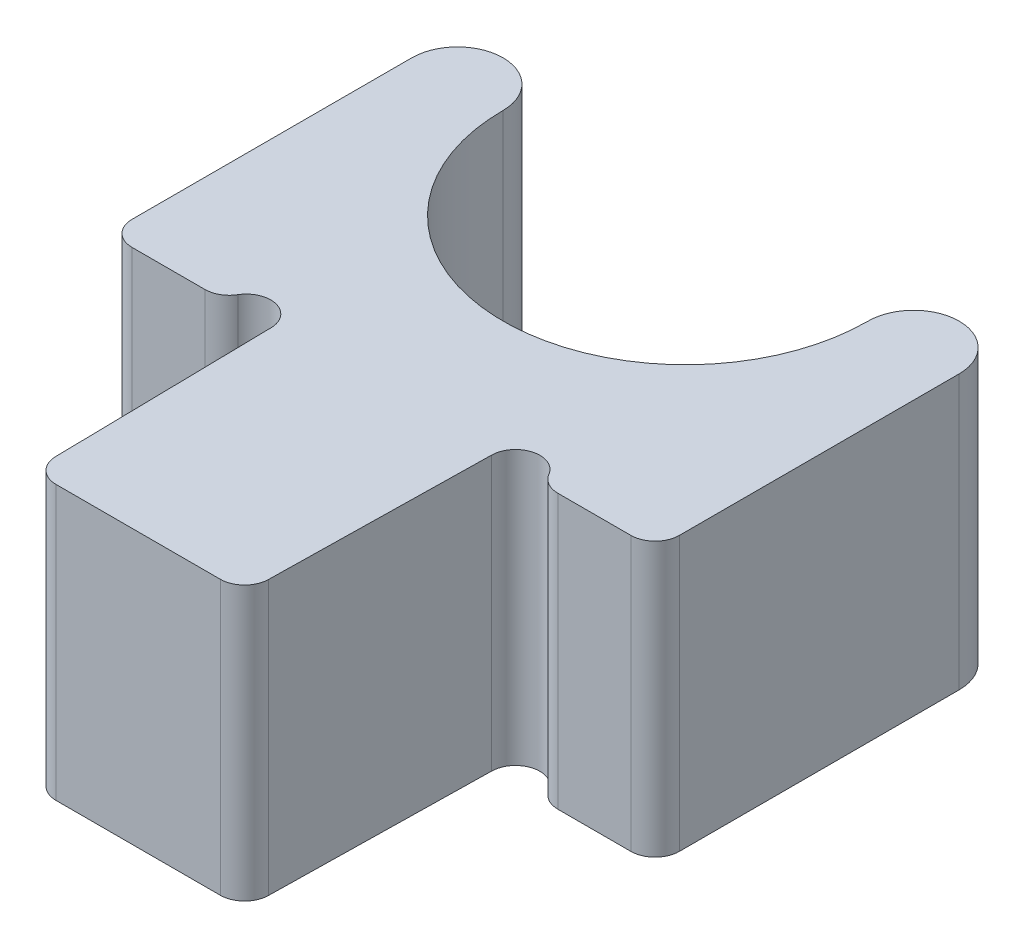
ISO-10303-21;
HEADER;
FILE_DESCRIPTION(('STEP AP214'),'2;1');
FILE_NAME('part.step','',(''),(''),'','','');
FILE_SCHEMA(('AUTOMOTIVE_DESIGN { 1 0 10303 214 1 1 1 1 }'));
ENDSEC;
DATA;
#1=APPLICATION_CONTEXT('core data for automotive mechanical design processes');
#2=APPLICATION_PROTOCOL_DEFINITION('international standard','automotive_design',2000,#1);
#3=PRODUCT_CONTEXT('',#1,'mechanical');
#4=PRODUCT('Part','Part','',(#3));
#5=PRODUCT_RELATED_PRODUCT_CATEGORY('part','',(#4));
#6=PRODUCT_DEFINITION_FORMATION('','',#4);
#7=PRODUCT_DEFINITION_CONTEXT('part definition',#1,'design');
#8=PRODUCT_DEFINITION('design','',#6,#7);
#9=PRODUCT_DEFINITION_SHAPE('','',#8);
#10=(LENGTH_UNIT() NAMED_UNIT(*) SI_UNIT(.MILLI.,.METRE.));
#11=(NAMED_UNIT(*) PLANE_ANGLE_UNIT() SI_UNIT($,.RADIAN.));
#12=(NAMED_UNIT(*) SI_UNIT($,.STERADIAN.) SOLID_ANGLE_UNIT());
#13=UNCERTAINTY_MEASURE_WITH_UNIT(LENGTH_MEASURE(1.E-05),#10,'distance_accuracy_value','');
#14=(GEOMETRIC_REPRESENTATION_CONTEXT(3) GLOBAL_UNCERTAINTY_ASSIGNED_CONTEXT((#13)) GLOBAL_UNIT_ASSIGNED_CONTEXT((#10,
#11,#12)) REPRESENTATION_CONTEXT('',''));
#15=CARTESIAN_POINT('',(0.,0.,0.));
#16=DIRECTION('',(0.,0.,1.));
#17=DIRECTION('',(1.,0.,0.));
#18=AXIS2_PLACEMENT_3D('',#15,#16,#17);
#19=CARTESIAN_POINT('',(-3.75,4.5,0.));
#20=DIRECTION('',(0.,-1.,0.));
#21=DIRECTION('',(0.,0.,-1.));
#22=AXIS2_PLACEMENT_3D('',#19,#20,#21);
#23=CYLINDRICAL_SURFACE('',#22,0.750000000000001);
#24=CARTESIAN_POINT('',(-3.75,0.,0.));
#25=DIRECTION('',(0.,1.,0.));
#26=DIRECTION('',(0.,0.,1.));
#27=AXIS2_PLACEMENT_3D('',#24,#25,#26);
#28=CIRCLE('',#27,0.750000000000001);
#29=CARTESIAN_POINT('',(-3.,0.,0.));
#30=VERTEX_POINT('',#29);
#31=CARTESIAN_POINT('',(-4.5,0.,0.));
#32=VERTEX_POINT('',#31);
#33=EDGE_CURVE('E189',#30,#32,#28,.T.);
#34=ORIENTED_EDGE('',*,*,#33,.T.);
#35=DIRECTION('',(0.,-1.,0.));
#36=VECTOR('',#35,1.);
#37=CARTESIAN_POINT('',(-4.5,4.5,0.));
#38=LINE('',#37,#36);
#39=CARTESIAN_POINT('',(-4.5,4.5,0.));
#40=VERTEX_POINT('',#39);
#41=EDGE_CURVE('E11',#40,#32,#38,.T.);
#42=ORIENTED_EDGE('',*,*,#41,.F.);
#43=CARTESIAN_POINT('',(-3.75,4.5,0.));
#44=DIRECTION('',(0.,1.,0.));
#45=DIRECTION('',(0.,0.,1.));
#46=AXIS2_PLACEMENT_3D('',#43,#44,#45);
#47=CIRCLE('',#46,0.750000000000001);
#48=CARTESIAN_POINT('',(-3.,4.5,0.));
#49=VERTEX_POINT('',#48);
#50=EDGE_CURVE('E223',#49,#40,#47,.T.);
#51=ORIENTED_EDGE('',*,*,#50,.F.);
#52=DIRECTION('',(0.,-1.,0.));
#53=VECTOR('',#52,1.);
#54=CARTESIAN_POINT('',(-3.,4.5,0.));
#55=LINE('',#54,#53);
#56=EDGE_CURVE('E185',#49,#30,#55,.T.);
#57=ORIENTED_EDGE('',*,*,#56,.T.);
#58=EDGE_LOOP('',(#34,#42,#51,#57));
#59=FACE_BOUND('',#58,.T.);
#60=ADVANCED_FACE('F33',(#59),#23,.T.);
#61=CARTESIAN_POINT('',(-4.5,4.5,0.));
#62=DIRECTION('',(1.,0.,0.));
#63=DIRECTION('',(0.,0.,-1.));
#64=AXIS2_PLACEMENT_3D('',#61,#62,#63);
#65=PLANE('',#64);
#66=DIRECTION('',(0.,0.,1.));
#67=VECTOR('',#66,1.);
#68=CARTESIAN_POINT('',(-4.5,0.,0.));
#69=LINE('',#68,#67);
#70=CARTESIAN_POINT('',(-4.5,0.,4.6));
#71=VERTEX_POINT('',#70);
#72=EDGE_CURVE('E192',#32,#71,#69,.T.);
#73=ORIENTED_EDGE('',*,*,#72,.T.);
#74=DIRECTION('',(0.,-1.,0.));
#75=VECTOR('',#74,1.);
#76=CARTESIAN_POINT('',(-4.5,4.5,4.6));
#77=LINE('',#76,#75);
#78=CARTESIAN_POINT('',(-4.5,4.5,4.6));
#79=VERTEX_POINT('',#78);
#80=EDGE_CURVE('E41',#79,#71,#77,.T.);
#81=ORIENTED_EDGE('',*,*,#80,.F.);
#82=DIRECTION('',(0.,0.,1.));
#83=VECTOR('',#82,1.);
#84=CARTESIAN_POINT('',(-4.5,4.5,0.));
#85=LINE('',#84,#83);
#86=EDGE_CURVE('E122',#40,#79,#85,.T.);
#87=ORIENTED_EDGE('',*,*,#86,.F.);
#88=ORIENTED_EDGE('',*,*,#41,.T.);
#89=EDGE_LOOP('',(#73,#81,#87,#88));
#90=FACE_BOUND('',#89,.T.);
#91=ADVANCED_FACE('F331',(#90),#65,.F.);
#92=CARTESIAN_POINT('',(-4.1,4.5,4.6));
#93=DIRECTION('',(0.,-1.,0.));
#94=DIRECTION('',(0.,0.,-1.));
#95=AXIS2_PLACEMENT_3D('',#92,#93,#94);
#96=CYLINDRICAL_SURFACE('',#95,0.4);
#97=CARTESIAN_POINT('',(-4.1,0.,4.6));
#98=DIRECTION('',(0.,1.,0.));
#99=DIRECTION('',(0.,0.,1.));
#100=AXIS2_PLACEMENT_3D('',#97,#98,#99);
#101=CIRCLE('',#100,0.4);
#102=CARTESIAN_POINT('',(-4.1,0.,5.));
#103=VERTEX_POINT('',#102);
#104=EDGE_CURVE('E194',#71,#103,#101,.T.);
#105=ORIENTED_EDGE('',*,*,#104,.T.);
#106=DIRECTION('',(0.,-1.,0.));
#107=VECTOR('',#106,1.);
#108=CARTESIAN_POINT('',(-4.1,4.5,5.));
#109=LINE('',#108,#107);
#110=CARTESIAN_POINT('',(-4.1,4.5,5.));
#111=VERTEX_POINT('',#110);
#112=EDGE_CURVE('E260',#111,#103,#109,.T.);
#113=ORIENTED_EDGE('',*,*,#112,.F.);
#114=CARTESIAN_POINT('',(-4.1,4.5,4.6));
#115=DIRECTION('',(0.,1.,0.));
#116=DIRECTION('',(0.,0.,1.));
#117=AXIS2_PLACEMENT_3D('',#114,#115,#116);
#118=CIRCLE('',#117,0.4);
#119=EDGE_CURVE('E268',#79,#111,#118,.T.);
#120=ORIENTED_EDGE('',*,*,#119,.F.);
#121=ORIENTED_EDGE('',*,*,#80,.T.);
#122=EDGE_LOOP('',(#105,#113,#120,#121));
#123=FACE_BOUND('',#122,.T.);
#124=ADVANCED_FACE('F266',(#123),#96,.T.);
#125=CARTESIAN_POINT('',(-2.90164185719014,4.5,5.));
#126=DIRECTION('',(0.,0.,-1.));
#127=DIRECTION('',(-1.,0.,0.));
#128=AXIS2_PLACEMENT_3D('',#125,#126,#127);
#129=PLANE('',#128);
#130=DIRECTION('',(1.,0.,0.));
#131=VECTOR('',#130,1.);
#132=CARTESIAN_POINT('',(-2.90164185719014,0.,5.));
#133=LINE('',#132,#131);
#134=CARTESIAN_POINT('',(-2.90164185719014,0.,5.));
#135=VERTEX_POINT('',#134);
#136=EDGE_CURVE('E196',#103,#135,#133,.T.);
#137=ORIENTED_EDGE('',*,*,#136,.T.);
#138=DIRECTION('',(0.,-1.,0.));
#139=VECTOR('',#138,1.);
#140=CARTESIAN_POINT('',(-2.90164185719014,4.5,5.));
#141=LINE('',#140,#139);
#142=CARTESIAN_POINT('',(-2.90164185719014,4.5,5.));
#143=VERTEX_POINT('',#142);
#144=EDGE_CURVE('E257',#143,#135,#141,.T.);
#145=ORIENTED_EDGE('',*,*,#144,.F.);
#146=DIRECTION('',(1.,0.,0.));
#147=VECTOR('',#146,1.);
#148=CARTESIAN_POINT('',(-2.90164185719014,4.5,5.));
#149=LINE('',#148,#147);
#150=EDGE_CURVE('E286',#111,#143,#149,.T.);
#151=ORIENTED_EDGE('',*,*,#150,.F.);
#152=ORIENTED_EDGE('',*,*,#112,.T.);
#153=EDGE_LOOP('',(#137,#145,#151,#152));
#154=FACE_BOUND('',#153,.T.);
#155=ADVANCED_FACE('F277',(#154),#129,.F.);
#156=CARTESIAN_POINT('',(-2.90164185719014,4.5,4.6));
#157=DIRECTION('',(0.,-1.,0.));
#158=DIRECTION('',(0.,0.,-1.));
#159=AXIS2_PLACEMENT_3D('',#156,#157,#158);
#160=CYLINDRICAL_SURFACE('',#159,0.4);
#161=CARTESIAN_POINT('',(-2.90164185719014,0.,4.6));
#162=DIRECTION('',(0.,1.,0.));
#163=DIRECTION('',(0.,0.,-1.));
#164=AXIS2_PLACEMENT_3D('',#161,#162,#163);
#165=CIRCLE('',#164,0.4);
#166=CARTESIAN_POINT('',(-2.55727051107464,0.,4.80349048128746));
#167=VERTEX_POINT('',#166);
#168=EDGE_CURVE('E198',#135,#167,#165,.T.);
#169=ORIENTED_EDGE('',*,*,#168,.T.);
#170=DIRECTION('',(0.,-1.,0.));
#171=VECTOR('',#170,1.);
#172=CARTESIAN_POINT('',(-2.55727051107464,4.5,4.80349048128746));
#173=LINE('',#172,#171);
#174=CARTESIAN_POINT('',(-2.55727051107464,4.5,4.80349048128746));
#175=VERTEX_POINT('',#174);
#176=EDGE_CURVE('E254',#175,#167,#173,.T.);
#177=ORIENTED_EDGE('',*,*,#176,.F.);
#178=CARTESIAN_POINT('',(-2.90164185719014,4.5,4.6));
#179=DIRECTION('',(0.,1.,0.));
#180=DIRECTION('',(0.,0.,-1.));
#181=AXIS2_PLACEMENT_3D('',#178,#179,#180);
#182=CIRCLE('',#181,0.4);
#183=EDGE_CURVE('E283',#143,#175,#182,.T.);
#184=ORIENTED_EDGE('',*,*,#183,.F.);
#185=ORIENTED_EDGE('',*,*,#144,.T.);
#186=EDGE_LOOP('',(#169,#177,#184,#185));
#187=FACE_BOUND('',#186,.T.);
#188=ADVANCED_FACE('F281',(#187),#160,.T.);
#189=CARTESIAN_POINT('',(-2.21289916495914,4.5,5.00698096257492));
#190=DIRECTION('',(0.,-1.,0.));
#191=DIRECTION('',(0.,0.,-1.));
#192=AXIS2_PLACEMENT_3D('',#189,#190,#191);
#193=CYLINDRICAL_SURFACE('',#192,0.4);
#194=CARTESIAN_POINT('',(-2.21289916495914,0.,5.00698096257492));
#195=DIRECTION('',(0.,-1.,0.));
#196=DIRECTION('',(0.,0.,1.));
#197=AXIS2_PLACEMENT_3D('',#194,#195,#196);
#198=CIRCLE('',#197,0.4);
#199=CARTESIAN_POINT('',(-1.81296008689659,0.,5.));
#200=VERTEX_POINT('',#199);
#201=EDGE_CURVE('E200',#167,#200,#198,.T.);
#202=ORIENTED_EDGE('',*,*,#201,.T.);
#203=DIRECTION('',(0.,-1.,0.));
#204=VECTOR('',#203,1.);
#205=CARTESIAN_POINT('',(-1.81296008689659,4.5,5.));
#206=LINE('',#205,#204);
#207=CARTESIAN_POINT('',(-1.81296008689659,4.5,5.));
#208=VERTEX_POINT('',#207);
#209=EDGE_CURVE('E251',#208,#200,#206,.T.);
#210=ORIENTED_EDGE('',*,*,#209,.F.);
#211=CARTESIAN_POINT('',(-2.21289916495914,4.5,5.00698096257492));
#212=DIRECTION('',(0.,-1.,0.));
#213=DIRECTION('',(0.,0.,1.));
#214=AXIS2_PLACEMENT_3D('',#211,#212,#213);
#215=CIRCLE('',#214,0.4);
#216=EDGE_CURVE('E285',#175,#208,#215,.T.);
#217=ORIENTED_EDGE('',*,*,#216,.F.);
#218=ORIENTED_EDGE('',*,*,#176,.T.);
#219=EDGE_LOOP('',(#202,#210,#217,#218));
#220=FACE_BOUND('',#219,.T.);
#221=ADVANCED_FACE('F344',(#220),#193,.F.);
#222=CARTESIAN_POINT('',(-1.81296008689659,4.5,5.));
#223=DIRECTION('',(0.999847695156391,0.,-0.0174524064372839));
#224=DIRECTION('',(-0.0174524064372839,0.,-0.999847695156391));
#225=AXIS2_PLACEMENT_3D('',#222,#223,#224);
#226=PLANE('',#225);
#227=DIRECTION('',(0.0174524064372839,0.,0.999847695156391));
#228=VECTOR('',#227,1.);
#229=CARTESIAN_POINT('',(-1.81296008689659,0.,5.));
#230=LINE('',#229,#228);
#231=CARTESIAN_POINT('',(-1.75,0.,8.60698096257492));
#232=VERTEX_POINT('',#231);
#233=EDGE_CURVE('E202',#200,#232,#230,.T.);
#234=ORIENTED_EDGE('',*,*,#233,.T.);
#235=DIRECTION('',(0.,-1.,0.));
#236=VECTOR('',#235,1.);
#237=CARTESIAN_POINT('',(-1.75,4.5,8.60698096257492));
#238=LINE('',#237,#236);
#239=CARTESIAN_POINT('',(-1.75,4.5,8.60698096257492));
#240=VERTEX_POINT('',#239);
#241=EDGE_CURVE('E248',#240,#232,#238,.T.);
#242=ORIENTED_EDGE('',*,*,#241,.F.);
#243=DIRECTION('',(0.0174524064372839,0.,0.999847695156391));
#244=VECTOR('',#243,1.);
#245=CARTESIAN_POINT('',(-1.81296008689659,4.5,5.));
#246=LINE('',#245,#244);
#247=EDGE_CURVE('E288',#208,#240,#246,.T.);
#248=ORIENTED_EDGE('',*,*,#247,.F.);
#249=ORIENTED_EDGE('',*,*,#209,.T.);
#250=EDGE_LOOP('',(#234,#242,#248,#249));
#251=FACE_BOUND('',#250,.T.);
#252=ADVANCED_FACE('F347',(#251),#226,.F.);
#253=CARTESIAN_POINT('',(-1.35006092193744,4.5,8.6));
#254=DIRECTION('',(0.,-1.,0.));
#255=DIRECTION('',(0.,0.,-1.));
#256=AXIS2_PLACEMENT_3D('',#253,#254,#255);
#257=CYLINDRICAL_SURFACE('',#256,0.4);
#258=CARTESIAN_POINT('',(-1.35006092193744,0.,8.6));
#259=DIRECTION('',(0.,1.,0.));
#260=DIRECTION('',(0.,0.,1.));
#261=AXIS2_PLACEMENT_3D('',#258,#259,#260);
#262=CIRCLE('',#261,0.4);
#263=CARTESIAN_POINT('',(-1.35006092193744,0.,9.));
#264=VERTEX_POINT('',#263);
#265=EDGE_CURVE('E204',#232,#264,#262,.T.);
#266=ORIENTED_EDGE('',*,*,#265,.T.);
#267=DIRECTION('',(0.,-1.,0.));
#268=VECTOR('',#267,1.);
#269=CARTESIAN_POINT('',(-1.35006092193744,4.5,9.));
#270=LINE('',#269,#268);
#271=CARTESIAN_POINT('',(-1.35006092193744,4.5,9.));
#272=VERTEX_POINT('',#271);
#273=EDGE_CURVE('E245',#272,#264,#270,.T.);
#274=ORIENTED_EDGE('',*,*,#273,.F.);
#275=CARTESIAN_POINT('',(-1.35006092193744,4.5,8.6));
#276=DIRECTION('',(0.,1.,0.));
#277=DIRECTION('',(0.,0.,1.));
#278=AXIS2_PLACEMENT_3D('',#275,#276,#277);
#279=CIRCLE('',#278,0.4);
#280=EDGE_CURVE('E294',#240,#272,#279,.T.);
#281=ORIENTED_EDGE('',*,*,#280,.F.);
#282=ORIENTED_EDGE('',*,*,#241,.T.);
#283=EDGE_LOOP('',(#266,#274,#281,#282));
#284=FACE_BOUND('',#283,.T.);
#285=ADVANCED_FACE('F351',(#284),#257,.T.);
#286=CARTESIAN_POINT('',(1.35006092193744,4.5,9.));
#287=DIRECTION('',(0.,0.,-1.));
#288=DIRECTION('',(-1.,0.,0.));
#289=AXIS2_PLACEMENT_3D('',#286,#287,#288);
#290=PLANE('',#289);
#291=DIRECTION('',(1.,0.,0.));
#292=VECTOR('',#291,1.);
#293=CARTESIAN_POINT('',(1.35006092193744,0.,9.));
#294=LINE('',#293,#292);
#295=CARTESIAN_POINT('',(1.35006092193744,0.,9.));
#296=VERTEX_POINT('',#295);
#297=EDGE_CURVE('E206',#264,#296,#294,.T.);
#298=ORIENTED_EDGE('',*,*,#297,.T.);
#299=DIRECTION('',(0.,-1.,0.));
#300=VECTOR('',#299,1.);
#301=CARTESIAN_POINT('',(1.35006092193744,4.5,9.));
#302=LINE('',#301,#300);
#303=CARTESIAN_POINT('',(1.35006092193744,4.5,9.));
#304=VERTEX_POINT('',#303);
#305=EDGE_CURVE('E242',#304,#296,#302,.T.);
#306=ORIENTED_EDGE('',*,*,#305,.F.);
#307=DIRECTION('',(1.,0.,0.));
#308=VECTOR('',#307,1.);
#309=CARTESIAN_POINT('',(1.35006092193744,4.5,9.));
#310=LINE('',#309,#308);
#311=EDGE_CURVE('E296',#272,#304,#310,.T.);
#312=ORIENTED_EDGE('',*,*,#311,.F.);
#313=ORIENTED_EDGE('',*,*,#273,.T.);
#314=EDGE_LOOP('',(#298,#306,#312,#313));
#315=FACE_BOUND('',#314,.T.);
#316=ADVANCED_FACE('F355',(#315),#290,.F.);
#317=CARTESIAN_POINT('',(1.35006092193744,4.5,8.6));
#318=DIRECTION('',(0.,-1.,0.));
#319=DIRECTION('',(0.,0.,-1.));
#320=AXIS2_PLACEMENT_3D('',#317,#318,#319);
#321=CYLINDRICAL_SURFACE('',#320,0.4);
#322=CARTESIAN_POINT('',(1.35006092193744,0.,8.6));
#323=DIRECTION('',(0.,1.,0.));
#324=DIRECTION('',(0.,0.,-1.));
#325=AXIS2_PLACEMENT_3D('',#322,#323,#324);
#326=CIRCLE('',#325,0.4);
#327=CARTESIAN_POINT('',(1.75,0.,8.60698096257492));
#328=VERTEX_POINT('',#327);
#329=EDGE_CURVE('E208',#296,#328,#326,.T.);
#330=ORIENTED_EDGE('',*,*,#329,.T.);
#331=DIRECTION('',(0.,-1.,0.));
#332=VECTOR('',#331,1.);
#333=CARTESIAN_POINT('',(1.75,4.5,8.60698096257492));
#334=LINE('',#333,#332);
#335=CARTESIAN_POINT('',(1.75,4.5,8.60698096257492));
#336=VERTEX_POINT('',#335);
#337=EDGE_CURVE('E239',#336,#328,#334,.T.);
#338=ORIENTED_EDGE('',*,*,#337,.F.);
#339=CARTESIAN_POINT('',(1.35006092193744,4.5,8.6));
#340=DIRECTION('',(0.,1.,0.));
#341=DIRECTION('',(0.,0.,-1.));
#342=AXIS2_PLACEMENT_3D('',#339,#340,#341);
#343=CIRCLE('',#342,0.4);
#344=EDGE_CURVE('E298',#304,#336,#343,.T.);
#345=ORIENTED_EDGE('',*,*,#344,.F.);
#346=ORIENTED_EDGE('',*,*,#305,.T.);
#347=EDGE_LOOP('',(#330,#338,#345,#346));
#348=FACE_BOUND('',#347,.T.);
#349=ADVANCED_FACE('F359',(#348),#321,.T.);
#350=CARTESIAN_POINT('',(1.81296008689659,4.5,5.));
#351=DIRECTION('',(-0.999847695156391,0.,-0.0174524064372836));
#352=DIRECTION('',(-0.0174524064372836,0.,0.999847695156391));
#353=AXIS2_PLACEMENT_3D('',#350,#351,#352);
#354=PLANE('',#353);
#355=DIRECTION('',(0.0174524064372836,0.,-0.999847695156391));
#356=VECTOR('',#355,1.);
#357=CARTESIAN_POINT('',(1.81296008689659,0.,5.));
#358=LINE('',#357,#356);
#359=CARTESIAN_POINT('',(1.81296008689659,0.,5.));
#360=VERTEX_POINT('',#359);
#361=EDGE_CURVE('E210',#328,#360,#358,.T.);
#362=ORIENTED_EDGE('',*,*,#361,.T.);
#363=DIRECTION('',(0.,-1.,0.));
#364=VECTOR('',#363,1.);
#365=CARTESIAN_POINT('',(1.81296008689659,4.5,5.));
#366=LINE('',#365,#364);
#367=CARTESIAN_POINT('',(1.81296008689659,4.5,5.));
#368=VERTEX_POINT('',#367);
#369=EDGE_CURVE('E236',#368,#360,#366,.T.);
#370=ORIENTED_EDGE('',*,*,#369,.F.);
#371=DIRECTION('',(0.0174524064372836,0.,-0.999847695156391));
#372=VECTOR('',#371,1.);
#373=CARTESIAN_POINT('',(1.81296008689659,4.5,5.));
#374=LINE('',#373,#372);
#375=EDGE_CURVE('E300',#336,#368,#374,.T.);
#376=ORIENTED_EDGE('',*,*,#375,.F.);
#377=ORIENTED_EDGE('',*,*,#337,.T.);
#378=EDGE_LOOP('',(#362,#370,#376,#377));
#379=FACE_BOUND('',#378,.T.);
#380=ADVANCED_FACE('F363',(#379),#354,.F.);
#381=CARTESIAN_POINT('',(2.21289916495915,4.5,5.00698096257491));
#382=DIRECTION('',(0.,-1.,0.));
#383=DIRECTION('',(0.,0.,-1.));
#384=AXIS2_PLACEMENT_3D('',#381,#382,#383);
#385=CYLINDRICAL_SURFACE('',#384,0.4);
#386=CARTESIAN_POINT('',(2.21289916495915,0.,5.00698096257491));
#387=DIRECTION('',(0.,-1.,0.));
#388=DIRECTION('',(0.,0.,-1.));
#389=AXIS2_PLACEMENT_3D('',#386,#387,#388);
#390=CIRCLE('',#389,0.4);
#391=CARTESIAN_POINT('',(2.55727051107464,0.,4.80349048128746));
#392=VERTEX_POINT('',#391);
#393=EDGE_CURVE('E212',#360,#392,#390,.T.);
#394=ORIENTED_EDGE('',*,*,#393,.T.);
#395=DIRECTION('',(0.,-1.,0.));
#396=VECTOR('',#395,1.);
#397=CARTESIAN_POINT('',(2.55727051107464,4.5,4.80349048128746));
#398=LINE('',#397,#396);
#399=CARTESIAN_POINT('',(2.55727051107464,4.5,4.80349048128746));
#400=VERTEX_POINT('',#399);
#401=EDGE_CURVE('E233',#400,#392,#398,.T.);
#402=ORIENTED_EDGE('',*,*,#401,.F.);
#403=CARTESIAN_POINT('',(2.21289916495915,4.5,5.00698096257491));
#404=DIRECTION('',(0.,-1.,0.));
#405=DIRECTION('',(0.,0.,-1.));
#406=AXIS2_PLACEMENT_3D('',#403,#404,#405);
#407=CIRCLE('',#406,0.4);
#408=EDGE_CURVE('E302',#368,#400,#407,.T.);
#409=ORIENTED_EDGE('',*,*,#408,.F.);
#410=ORIENTED_EDGE('',*,*,#369,.T.);
#411=EDGE_LOOP('',(#394,#402,#409,#410));
#412=FACE_BOUND('',#411,.T.);
#413=ADVANCED_FACE('F367',(#412),#385,.F.);
#414=CARTESIAN_POINT('',(2.90164185719014,4.5,4.6));
#415=DIRECTION('',(0.,-1.,0.));
#416=DIRECTION('',(0.,0.,-1.));
#417=AXIS2_PLACEMENT_3D('',#414,#415,#416);
#418=CYLINDRICAL_SURFACE('',#417,0.4);
#419=CARTESIAN_POINT('',(2.90164185719014,0.,4.6));
#420=DIRECTION('',(0.,1.,0.));
#421=DIRECTION('',(0.,0.,1.));
#422=AXIS2_PLACEMENT_3D('',#419,#420,#421);
#423=CIRCLE('',#422,0.4);
#424=CARTESIAN_POINT('',(2.90164185719014,0.,5.));
#425=VERTEX_POINT('',#424);
#426=EDGE_CURVE('E214',#392,#425,#423,.T.);
#427=ORIENTED_EDGE('',*,*,#426,.T.);
#428=DIRECTION('',(0.,-1.,0.));
#429=VECTOR('',#428,1.);
#430=CARTESIAN_POINT('',(2.90164185719014,4.5,5.));
#431=LINE('',#430,#429);
#432=CARTESIAN_POINT('',(2.90164185719014,4.5,5.));
#433=VERTEX_POINT('',#432);
#434=EDGE_CURVE('E230',#433,#425,#431,.T.);
#435=ORIENTED_EDGE('',*,*,#434,.F.);
#436=CARTESIAN_POINT('',(2.90164185719014,4.5,4.6));
#437=DIRECTION('',(0.,1.,0.));
#438=DIRECTION('',(0.,0.,1.));
#439=AXIS2_PLACEMENT_3D('',#436,#437,#438);
#440=CIRCLE('',#439,0.4);
#441=EDGE_CURVE('E304',#400,#433,#440,.T.);
#442=ORIENTED_EDGE('',*,*,#441,.F.);
#443=ORIENTED_EDGE('',*,*,#401,.T.);
#444=EDGE_LOOP('',(#427,#435,#442,#443));
#445=FACE_BOUND('',#444,.T.);
#446=ADVANCED_FACE('F371',(#445),#418,.T.);
#447=CARTESIAN_POINT('',(2.90164185719014,4.5,5.));
#448=DIRECTION('',(0.,0.,-1.));
#449=DIRECTION('',(-1.,0.,0.));
#450=AXIS2_PLACEMENT_3D('',#447,#448,#449);
#451=PLANE('',#450);
#452=DIRECTION('',(1.,0.,0.));
#453=VECTOR('',#452,1.);
#454=CARTESIAN_POINT('',(2.90164185719014,0.,5.));
#455=LINE('',#454,#453);
#456=CARTESIAN_POINT('',(4.1,0.,5.));
#457=VERTEX_POINT('',#456);
#458=EDGE_CURVE('E216',#425,#457,#455,.T.);
#459=ORIENTED_EDGE('',*,*,#458,.T.);
#460=DIRECTION('',(0.,-1.,0.));
#461=VECTOR('',#460,1.);
#462=CARTESIAN_POINT('',(4.1,4.5,5.));
#463=LINE('',#462,#461);
#464=CARTESIAN_POINT('',(4.1,4.5,5.));
#465=VERTEX_POINT('',#464);
#466=EDGE_CURVE('E227',#465,#457,#463,.T.);
#467=ORIENTED_EDGE('',*,*,#466,.F.);
#468=DIRECTION('',(1.,0.,0.));
#469=VECTOR('',#468,1.);
#470=CARTESIAN_POINT('',(2.90164185719014,4.5,5.));
#471=LINE('',#470,#469);
#472=EDGE_CURVE('E306',#433,#465,#471,.T.);
#473=ORIENTED_EDGE('',*,*,#472,.F.);
#474=ORIENTED_EDGE('',*,*,#434,.T.);
#475=EDGE_LOOP('',(#459,#467,#473,#474));
#476=FACE_BOUND('',#475,.T.);
#477=ADVANCED_FACE('F312',(#476),#451,.F.);
#478=CARTESIAN_POINT('',(4.1,4.5,4.6));
#479=DIRECTION('',(0.,-1.,0.));
#480=DIRECTION('',(0.,0.,-1.));
#481=AXIS2_PLACEMENT_3D('',#478,#479,#480);
#482=CYLINDRICAL_SURFACE('',#481,0.4);
#483=CARTESIAN_POINT('',(4.1,0.,4.6));
#484=DIRECTION('',(0.,1.,0.));
#485=DIRECTION('',(0.,0.,-1.));
#486=AXIS2_PLACEMENT_3D('',#483,#484,#485);
#487=CIRCLE('',#486,0.4);
#488=CARTESIAN_POINT('',(4.5,0.,4.6));
#489=VERTEX_POINT('',#488);
#490=EDGE_CURVE('E218',#457,#489,#487,.T.);
#491=ORIENTED_EDGE('',*,*,#490,.T.);
#492=DIRECTION('',(0.,-1.,0.));
#493=VECTOR('',#492,1.);
#494=CARTESIAN_POINT('',(4.5,4.5,4.6));
#495=LINE('',#494,#493);
#496=CARTESIAN_POINT('',(4.5,4.5,4.6));
#497=VERTEX_POINT('',#496);
#498=EDGE_CURVE('E180',#497,#489,#495,.T.);
#499=ORIENTED_EDGE('',*,*,#498,.F.);
#500=CARTESIAN_POINT('',(4.1,4.5,4.6));
#501=DIRECTION('',(0.,1.,0.));
#502=DIRECTION('',(0.,0.,-1.));
#503=AXIS2_PLACEMENT_3D('',#500,#501,#502);
#504=CIRCLE('',#503,0.4);
#505=EDGE_CURVE('E171',#465,#497,#504,.T.);
#506=ORIENTED_EDGE('',*,*,#505,.F.);
#507=ORIENTED_EDGE('',*,*,#466,.T.);
#508=EDGE_LOOP('',(#491,#499,#506,#507));
#509=FACE_BOUND('',#508,.T.);
#510=ADVANCED_FACE('F316',(#509),#482,.T.);
#511=CARTESIAN_POINT('',(4.5,4.5,0.));
#512=DIRECTION('',(-1.,0.,0.));
#513=DIRECTION('',(0.,0.,1.));
#514=AXIS2_PLACEMENT_3D('',#511,#512,#513);
#515=PLANE('',#514);
#516=DIRECTION('',(0.,0.,-1.));
#517=VECTOR('',#516,1.);
#518=CARTESIAN_POINT('',(4.5,0.,0.));
#519=LINE('',#518,#517);
#520=CARTESIAN_POINT('',(4.5,0.,0.));
#521=VERTEX_POINT('',#520);
#522=EDGE_CURVE('E179',#489,#521,#519,.T.);
#523=ORIENTED_EDGE('',*,*,#522,.T.);
#524=DIRECTION('',(0.,-1.,0.));
#525=VECTOR('',#524,1.);
#526=CARTESIAN_POINT('',(4.5,4.5,0.));
#527=LINE('',#526,#525);
#528=CARTESIAN_POINT('',(4.5,4.5,0.));
#529=VERTEX_POINT('',#528);
#530=EDGE_CURVE('E176',#529,#521,#527,.T.);
#531=ORIENTED_EDGE('',*,*,#530,.F.);
#532=DIRECTION('',(0.,0.,-1.));
#533=VECTOR('',#532,1.);
#534=CARTESIAN_POINT('',(4.5,4.5,0.));
#535=LINE('',#534,#533);
#536=EDGE_CURVE('E165',#497,#529,#535,.T.);
#537=ORIENTED_EDGE('',*,*,#536,.F.);
#538=ORIENTED_EDGE('',*,*,#498,.T.);
#539=EDGE_LOOP('',(#523,#531,#537,#538));
#540=FACE_BOUND('',#539,.T.);
#541=ADVANCED_FACE('F177',(#540),#515,.F.);
#542=CARTESIAN_POINT('',(3.75,4.5,0.));
#543=DIRECTION('',(0.,-1.,0.));
#544=DIRECTION('',(0.,0.,-1.));
#545=AXIS2_PLACEMENT_3D('',#542,#543,#544);
#546=CYLINDRICAL_SURFACE('',#545,0.750000000000001);
#547=CARTESIAN_POINT('',(3.75,0.,0.));
#548=DIRECTION('',(0.,1.,0.));
#549=DIRECTION('',(0.,0.,-1.));
#550=AXIS2_PLACEMENT_3D('',#547,#548,#549);
#551=CIRCLE('',#550,0.750000000000001);
#552=CARTESIAN_POINT('',(3.,0.,0.));
#553=VERTEX_POINT('',#552);
#554=EDGE_CURVE('E108',#521,#553,#551,.T.);
#555=ORIENTED_EDGE('',*,*,#554,.T.);
#556=DIRECTION('',(0.,-1.,0.));
#557=VECTOR('',#556,1.);
#558=CARTESIAN_POINT('',(3.,4.5,0.));
#559=LINE('',#558,#557);
#560=CARTESIAN_POINT('',(3.,4.5,0.));
#561=VERTEX_POINT('',#560);
#562=EDGE_CURVE('E181',#561,#553,#559,.T.);
#563=ORIENTED_EDGE('',*,*,#562,.F.);
#564=CARTESIAN_POINT('',(3.75,4.5,0.));
#565=DIRECTION('',(0.,1.,0.));
#566=DIRECTION('',(0.,0.,-1.));
#567=AXIS2_PLACEMENT_3D('',#564,#565,#566);
#568=CIRCLE('',#567,0.750000000000001);
#569=EDGE_CURVE('E169',#529,#561,#568,.T.);
#570=ORIENTED_EDGE('',*,*,#569,.F.);
#571=ORIENTED_EDGE('',*,*,#530,.T.);
#572=EDGE_LOOP('',(#555,#563,#570,#571));
#573=FACE_BOUND('',#572,.T.);
#574=ADVANCED_FACE('F183',(#573),#546,.T.);
#575=CARTESIAN_POINT('',(0.,4.5,0.));
#576=DIRECTION('',(0.,-1.,0.));
#577=DIRECTION('',(0.,0.,-1.));
#578=AXIS2_PLACEMENT_3D('',#575,#576,#577);
#579=CYLINDRICAL_SURFACE('',#578,3.);
#580=CARTESIAN_POINT('',(0.,0.,0.));
#581=DIRECTION('',(0.,-1.,0.));
#582=DIRECTION('',(0.,0.,1.));
#583=AXIS2_PLACEMENT_3D('',#580,#581,#582);
#584=CIRCLE('',#583,3.);
#585=EDGE_CURVE('E114',#553,#30,#584,.T.);
#586=ORIENTED_EDGE('',*,*,#585,.T.);
#587=ORIENTED_EDGE('',*,*,#56,.F.);
#588=CARTESIAN_POINT('',(0.,4.5,0.));
#589=DIRECTION('',(0.,-1.,0.));
#590=DIRECTION('',(0.,0.,1.));
#591=AXIS2_PLACEMENT_3D('',#588,#589,#590);
#592=CIRCLE('',#591,3.);
#593=EDGE_CURVE('E49',#561,#49,#592,.T.);
#594=ORIENTED_EDGE('',*,*,#593,.F.);
#595=ORIENTED_EDGE('',*,*,#562,.T.);
#596=EDGE_LOOP('',(#586,#587,#594,#595));
#597=FACE_BOUND('',#596,.T.);
#598=ADVANCED_FACE('F320',(#597),#579,.F.);
#599=CARTESIAN_POINT('',(-3.75,4.5,0.));
#600=DIRECTION('',(0.,1.,0.));
#601=DIRECTION('',(0.,0.,1.));
#602=AXIS2_PLACEMENT_3D('',#599,#600,#601);
#603=PLANE('',#602);
#604=ORIENTED_EDGE('',*,*,#50,.T.);
#605=ORIENTED_EDGE('',*,*,#86,.T.);
#606=ORIENTED_EDGE('',*,*,#119,.T.);
#607=ORIENTED_EDGE('',*,*,#150,.T.);
#608=ORIENTED_EDGE('',*,*,#183,.T.);
#609=ORIENTED_EDGE('',*,*,#216,.T.);
#610=ORIENTED_EDGE('',*,*,#247,.T.);
#611=ORIENTED_EDGE('',*,*,#280,.T.);
#612=ORIENTED_EDGE('',*,*,#311,.T.);
#613=ORIENTED_EDGE('',*,*,#344,.T.);
#614=ORIENTED_EDGE('',*,*,#375,.T.);
#615=ORIENTED_EDGE('',*,*,#408,.T.);
#616=ORIENTED_EDGE('',*,*,#441,.T.);
#617=ORIENTED_EDGE('',*,*,#472,.T.);
#618=ORIENTED_EDGE('',*,*,#505,.T.);
#619=ORIENTED_EDGE('',*,*,#536,.T.);
#620=ORIENTED_EDGE('',*,*,#569,.T.);
#621=ORIENTED_EDGE('',*,*,#593,.T.);
#622=EDGE_LOOP('',(#604,#605,#606,#607,#608,#609,#610,#611,#612,#613,#614,#615,#616,#617,#618,
#619,#620,#621));
#623=FACE_BOUND('',#622,.T.);
#624=ADVANCED_FACE('F167',(#623),#603,.T.);
#625=CARTESIAN_POINT('',(-3.75,0.,0.));
#626=DIRECTION('',(0.,1.,0.));
#627=DIRECTION('',(0.,0.,1.));
#628=AXIS2_PLACEMENT_3D('',#625,#626,#627);
#629=PLANE('',#628);
#630=ORIENTED_EDGE('',*,*,#33,.F.);
#631=ORIENTED_EDGE('',*,*,#585,.F.);
#632=ORIENTED_EDGE('',*,*,#554,.F.);
#633=ORIENTED_EDGE('',*,*,#522,.F.);
#634=ORIENTED_EDGE('',*,*,#490,.F.);
#635=ORIENTED_EDGE('',*,*,#458,.F.);
#636=ORIENTED_EDGE('',*,*,#426,.F.);
#637=ORIENTED_EDGE('',*,*,#393,.F.);
#638=ORIENTED_EDGE('',*,*,#361,.F.);
#639=ORIENTED_EDGE('',*,*,#329,.F.);
#640=ORIENTED_EDGE('',*,*,#297,.F.);
#641=ORIENTED_EDGE('',*,*,#265,.F.);
#642=ORIENTED_EDGE('',*,*,#233,.F.);
#643=ORIENTED_EDGE('',*,*,#201,.F.);
#644=ORIENTED_EDGE('',*,*,#168,.F.);
#645=ORIENTED_EDGE('',*,*,#136,.F.);
#646=ORIENTED_EDGE('',*,*,#104,.F.);
#647=ORIENTED_EDGE('',*,*,#72,.F.);
#648=EDGE_LOOP('',(#630,#631,#632,#633,#634,#635,#636,#637,#638,#639,#640,#641,#642,#643,#644,
#645,#646,#647));
#649=FACE_BOUND('',#648,.T.);
#650=ADVANCED_FACE('F272',(#649),#629,.F.);
#651=CLOSED_SHELL('',(#60,#91,#124,#155,#188,#221,#252,#285,#316,#349,#380,#413,#446,#477,#510,
#541,#574,#598,#624,#650));
#652=MANIFOLD_SOLID_BREP('B2',#651);
#653=ADVANCED_BREP_SHAPE_REPRESENTATION('',(#18,#652),#14);
#654=SHAPE_DEFINITION_REPRESENTATION(#9,#653);
ENDSEC;
END-ISO-10303-21;
